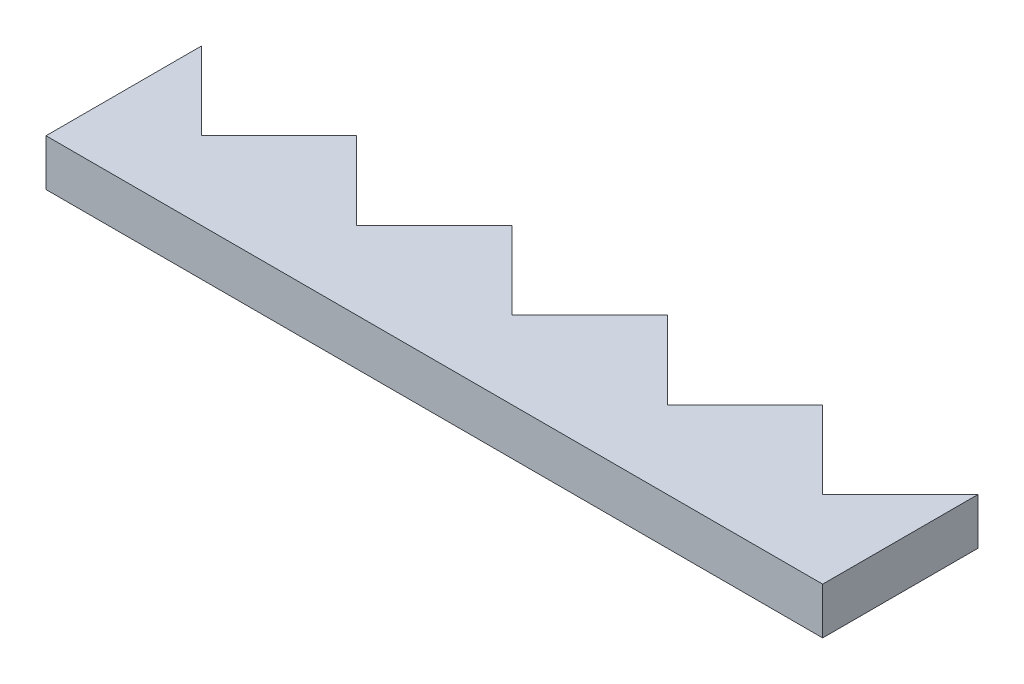
ISO-10303-21;
HEADER;
FILE_DESCRIPTION(('STEP AP214'),'2;1');
FILE_NAME('part.step','',(''),(''),'','','');
FILE_SCHEMA(('AUTOMOTIVE_DESIGN { 1 0 10303 214 1 1 1 1 }'));
ENDSEC;
DATA;
#1=APPLICATION_CONTEXT('core data for automotive mechanical design processes');
#2=APPLICATION_PROTOCOL_DEFINITION('international standard','automotive_design',2000,#1);
#3=PRODUCT_CONTEXT('',#1,'mechanical');
#4=PRODUCT('Part','Part','',(#3));
#5=PRODUCT_RELATED_PRODUCT_CATEGORY('part','',(#4));
#6=PRODUCT_DEFINITION_FORMATION('','',#4);
#7=PRODUCT_DEFINITION_CONTEXT('part definition',#1,'design');
#8=PRODUCT_DEFINITION('design','',#6,#7);
#9=PRODUCT_DEFINITION_SHAPE('','',#8);
#10=(LENGTH_UNIT() NAMED_UNIT(*) SI_UNIT(.MILLI.,.METRE.));
#11=(NAMED_UNIT(*) PLANE_ANGLE_UNIT() SI_UNIT($,.RADIAN.));
#12=(NAMED_UNIT(*) SI_UNIT($,.STERADIAN.) SOLID_ANGLE_UNIT());
#13=UNCERTAINTY_MEASURE_WITH_UNIT(LENGTH_MEASURE(1.E-05),#10,'distance_accuracy_value','');
#14=(GEOMETRIC_REPRESENTATION_CONTEXT(3) GLOBAL_UNCERTAINTY_ASSIGNED_CONTEXT((#13)) GLOBAL_UNIT_ASSIGNED_CONTEXT((#10,
#11,#12)) REPRESENTATION_CONTEXT('',''));
#15=CARTESIAN_POINT('',(0.,0.,0.));
#16=DIRECTION('',(0.,0.,1.));
#17=DIRECTION('',(1.,0.,0.));
#18=AXIS2_PLACEMENT_3D('',#15,#16,#17);
#19=CARTESIAN_POINT('',(0.,3.33025149712782,0.));
#20=DIRECTION('',(0.,0.,-1.));
#21=DIRECTION('',(-1.,0.,0.));
#22=AXIS2_PLACEMENT_3D('',#19,#20,#21);
#23=PLANE('',#22);
#24=DIRECTION('',(1.,0.,0.));
#25=VECTOR('',#24,1.);
#26=CARTESIAN_POINT('',(0.,0.330251497127817,0.));
#27=LINE('',#26,#25);
#28=CARTESIAN_POINT('',(0.,0.330251497127817,0.));
#29=VERTEX_POINT('',#28);
#30=CARTESIAN_POINT('',(50.,0.330251497127817,0.));
#31=VERTEX_POINT('',#30);
#32=EDGE_CURVE('E159',#29,#31,#27,.T.);
#33=ORIENTED_EDGE('',*,*,#32,.T.);
#34=DIRECTION('',(0.,-1.,0.));
#35=VECTOR('',#34,1.);
#36=CARTESIAN_POINT('',(50.,3.33025149712782,0.));
#37=LINE('',#36,#35);
#38=CARTESIAN_POINT('',(50.,3.33025149712782,0.));
#39=VERTEX_POINT('',#38);
#40=EDGE_CURVE('E11',#39,#31,#37,.T.);
#41=ORIENTED_EDGE('',*,*,#40,.F.);
#42=DIRECTION('',(1.,0.,0.));
#43=VECTOR('',#42,1.);
#44=CARTESIAN_POINT('',(0.,3.33025149712782,0.));
#45=LINE('',#44,#43);
#46=CARTESIAN_POINT('',(0.,3.33025149712782,0.));
#47=VERTEX_POINT('',#46);
#48=EDGE_CURVE('E183',#47,#39,#45,.T.);
#49=ORIENTED_EDGE('',*,*,#48,.F.);
#50=DIRECTION('',(0.,-1.,0.));
#51=VECTOR('',#50,1.);
#52=CARTESIAN_POINT('',(0.,3.33025149712782,0.));
#53=LINE('',#52,#51);
#54=EDGE_CURVE('E155',#47,#29,#53,.T.);
#55=ORIENTED_EDGE('',*,*,#54,.T.);
#56=EDGE_LOOP('',(#33,#41,#49,#55));
#57=FACE_BOUND('',#56,.T.);
#58=ADVANCED_FACE('F33',(#57),#23,.F.);
#59=CARTESIAN_POINT('',(50.,3.33025149712782,0.));
#60=DIRECTION('',(-1.,0.,0.));
#61=DIRECTION('',(0.,0.,1.));
#62=AXIS2_PLACEMENT_3D('',#59,#60,#61);
#63=PLANE('',#62);
#64=DIRECTION('',(0.,0.,-1.));
#65=VECTOR('',#64,1.);
#66=CARTESIAN_POINT('',(50.,0.330251497127817,0.));
#67=LINE('',#66,#65);
#68=CARTESIAN_POINT('',(50.,0.330251497127817,-10.));
#69=VERTEX_POINT('',#68);
#70=EDGE_CURVE('E162',#31,#69,#67,.T.);
#71=ORIENTED_EDGE('',*,*,#70,.T.);
#72=DIRECTION('',(0.,-1.,0.));
#73=VECTOR('',#72,1.);
#74=CARTESIAN_POINT('',(50.,3.33025149712782,-10.));
#75=LINE('',#74,#73);
#76=CARTESIAN_POINT('',(50.,3.33025149712782,-10.));
#77=VERTEX_POINT('',#76);
#78=EDGE_CURVE('E41',#77,#69,#75,.T.);
#79=ORIENTED_EDGE('',*,*,#78,.F.);
#80=DIRECTION('',(0.,0.,-1.));
#81=VECTOR('',#80,1.);
#82=CARTESIAN_POINT('',(50.,3.33025149712782,0.));
#83=LINE('',#82,#81);
#84=EDGE_CURVE('E107',#39,#77,#83,.T.);
#85=ORIENTED_EDGE('',*,*,#84,.F.);
#86=ORIENTED_EDGE('',*,*,#40,.T.);
#87=EDGE_LOOP('',(#71,#79,#85,#86));
#88=FACE_BOUND('',#87,.T.);
#89=ADVANCED_FACE('F266',(#88),#63,.F.);
#90=CARTESIAN_POINT('',(45.,3.33025149712782,-5.));
#91=DIRECTION('',(0.707106781186547,0.,0.707106781186548));
#92=DIRECTION('',(0.707106781186548,0.,-0.707106781186547));
#93=AXIS2_PLACEMENT_3D('',#90,#91,#92);
#94=PLANE('',#93);
#95=DIRECTION('',(-0.707106781186548,0.,0.707106781186547));
#96=VECTOR('',#95,1.);
#97=CARTESIAN_POINT('',(45.,0.330251497127817,-5.));
#98=LINE('',#97,#96);
#99=CARTESIAN_POINT('',(45.,0.330251497127817,-5.));
#100=VERTEX_POINT('',#99);
#101=EDGE_CURVE('E164',#69,#100,#98,.T.);
#102=ORIENTED_EDGE('',*,*,#101,.T.);
#103=DIRECTION('',(0.,-1.,0.));
#104=VECTOR('',#103,1.);
#105=CARTESIAN_POINT('',(45.,3.33025149712782,-5.));
#106=LINE('',#105,#104);
#107=CARTESIAN_POINT('',(45.,3.33025149712782,-5.));
#108=VERTEX_POINT('',#107);
#109=EDGE_CURVE('E205',#108,#100,#106,.T.);
#110=ORIENTED_EDGE('',*,*,#109,.F.);
#111=DIRECTION('',(-0.707106781186548,0.,0.707106781186547));
#112=VECTOR('',#111,1.);
#113=CARTESIAN_POINT('',(45.,3.33025149712782,-5.));
#114=LINE('',#113,#112);
#115=EDGE_CURVE('E213',#77,#108,#114,.T.);
#116=ORIENTED_EDGE('',*,*,#115,.F.);
#117=ORIENTED_EDGE('',*,*,#78,.T.);
#118=EDGE_LOOP('',(#102,#110,#116,#117));
#119=FACE_BOUND('',#118,.T.);
#120=ADVANCED_FACE('F211',(#119),#94,.F.);
#121=CARTESIAN_POINT('',(40.,3.33025149712782,-10.));
#122=DIRECTION('',(-0.707106781186548,0.,0.707106781186547));
#123=DIRECTION('',(0.707106781186547,0.,0.707106781186548));
#124=AXIS2_PLACEMENT_3D('',#121,#122,#123);
#125=PLANE('',#124);
#126=DIRECTION('',(-0.707106781186547,0.,-0.707106781186548));
#127=VECTOR('',#126,1.);
#128=CARTESIAN_POINT('',(40.,0.330251497127817,-10.));
#129=LINE('',#128,#127);
#130=CARTESIAN_POINT('',(40.,0.330251497127817,-10.));
#131=VERTEX_POINT('',#130);
#132=EDGE_CURVE('E166',#100,#131,#129,.T.);
#133=ORIENTED_EDGE('',*,*,#132,.T.);
#134=DIRECTION('',(0.,-1.,0.));
#135=VECTOR('',#134,1.);
#136=CARTESIAN_POINT('',(40.,3.33025149712782,-10.));
#137=LINE('',#136,#135);
#138=CARTESIAN_POINT('',(40.,3.33025149712782,-10.));
#139=VERTEX_POINT('',#138);
#140=EDGE_CURVE('E202',#139,#131,#137,.T.);
#141=ORIENTED_EDGE('',*,*,#140,.F.);
#142=DIRECTION('',(-0.707106781186547,0.,-0.707106781186548));
#143=VECTOR('',#142,1.);
#144=CARTESIAN_POINT('',(40.,3.33025149712782,-10.));
#145=LINE('',#144,#143);
#146=EDGE_CURVE('E231',#108,#139,#145,.T.);
#147=ORIENTED_EDGE('',*,*,#146,.F.);
#148=ORIENTED_EDGE('',*,*,#109,.T.);
#149=EDGE_LOOP('',(#133,#141,#147,#148));
#150=FACE_BOUND('',#149,.T.);
#151=ADVANCED_FACE('F222',(#150),#125,.F.);
#152=CARTESIAN_POINT('',(35.,3.33025149712782,-5.));
#153=DIRECTION('',(0.707106781186547,0.,0.707106781186548));
#154=DIRECTION('',(0.707106781186548,0.,-0.707106781186547));
#155=AXIS2_PLACEMENT_3D('',#152,#153,#154);
#156=PLANE('',#155);
#157=DIRECTION('',(-0.707106781186548,0.,0.707106781186547));
#158=VECTOR('',#157,1.);
#159=CARTESIAN_POINT('',(35.,0.330251497127817,-5.));
#160=LINE('',#159,#158);
#161=CARTESIAN_POINT('',(35.,0.330251497127817,-5.));
#162=VERTEX_POINT('',#161);
#163=EDGE_CURVE('E168',#131,#162,#160,.T.);
#164=ORIENTED_EDGE('',*,*,#163,.T.);
#165=DIRECTION('',(0.,-1.,0.));
#166=VECTOR('',#165,1.);
#167=CARTESIAN_POINT('',(35.,3.33025149712782,-5.));
#168=LINE('',#167,#166);
#169=CARTESIAN_POINT('',(35.,3.33025149712782,-5.));
#170=VERTEX_POINT('',#169);
#171=EDGE_CURVE('E199',#170,#162,#168,.T.);
#172=ORIENTED_EDGE('',*,*,#171,.F.);
#173=DIRECTION('',(-0.707106781186548,0.,0.707106781186547));
#174=VECTOR('',#173,1.);
#175=CARTESIAN_POINT('',(35.,3.33025149712782,-5.));
#176=LINE('',#175,#174);
#177=EDGE_CURVE('E228',#139,#170,#176,.T.);
#178=ORIENTED_EDGE('',*,*,#177,.F.);
#179=ORIENTED_EDGE('',*,*,#140,.T.);
#180=EDGE_LOOP('',(#164,#172,#178,#179));
#181=FACE_BOUND('',#180,.T.);
#182=ADVANCED_FACE('F226',(#181),#156,.F.);
#183=CARTESIAN_POINT('',(30.,3.33025149712782,-10.));
#184=DIRECTION('',(-0.707106781186548,0.,0.707106781186547));
#185=DIRECTION('',(0.707106781186547,0.,0.707106781186548));
#186=AXIS2_PLACEMENT_3D('',#183,#184,#185);
#187=PLANE('',#186);
#188=DIRECTION('',(-0.707106781186547,0.,-0.707106781186548));
#189=VECTOR('',#188,1.);
#190=CARTESIAN_POINT('',(30.,0.330251497127817,-10.));
#191=LINE('',#190,#189);
#192=CARTESIAN_POINT('',(30.,0.330251497127817,-10.));
#193=VERTEX_POINT('',#192);
#194=EDGE_CURVE('E170',#162,#193,#191,.T.);
#195=ORIENTED_EDGE('',*,*,#194,.T.);
#196=DIRECTION('',(0.,-1.,0.));
#197=VECTOR('',#196,1.);
#198=CARTESIAN_POINT('',(30.,3.33025149712782,-10.));
#199=LINE('',#198,#197);
#200=CARTESIAN_POINT('',(30.,3.33025149712782,-10.));
#201=VERTEX_POINT('',#200);
#202=EDGE_CURVE('E196',#201,#193,#199,.T.);
#203=ORIENTED_EDGE('',*,*,#202,.F.);
#204=DIRECTION('',(-0.707106781186547,0.,-0.707106781186548));
#205=VECTOR('',#204,1.);
#206=CARTESIAN_POINT('',(30.,3.33025149712782,-10.));
#207=LINE('',#206,#205);
#208=EDGE_CURVE('E230',#170,#201,#207,.T.);
#209=ORIENTED_EDGE('',*,*,#208,.F.);
#210=ORIENTED_EDGE('',*,*,#171,.T.);
#211=EDGE_LOOP('',(#195,#203,#209,#210));
#212=FACE_BOUND('',#211,.T.);
#213=ADVANCED_FACE('F279',(#212),#187,.F.);
#214=CARTESIAN_POINT('',(25.,3.33025149712782,-5.));
#215=DIRECTION('',(0.707106781186548,0.,0.707106781186547));
#216=DIRECTION('',(0.707106781186547,0.,-0.707106781186548));
#217=AXIS2_PLACEMENT_3D('',#214,#215,#216);
#218=PLANE('',#217);
#219=DIRECTION('',(-0.707106781186547,0.,0.707106781186548));
#220=VECTOR('',#219,1.);
#221=CARTESIAN_POINT('',(25.,0.330251497127817,-5.));
#222=LINE('',#221,#220);
#223=CARTESIAN_POINT('',(25.,0.330251497127817,-5.));
#224=VERTEX_POINT('',#223);
#225=EDGE_CURVE('E172',#193,#224,#222,.T.);
#226=ORIENTED_EDGE('',*,*,#225,.T.);
#227=DIRECTION('',(0.,-1.,0.));
#228=VECTOR('',#227,1.);
#229=CARTESIAN_POINT('',(25.,3.33025149712782,-5.));
#230=LINE('',#229,#228);
#231=CARTESIAN_POINT('',(25.,3.33025149712782,-5.));
#232=VERTEX_POINT('',#231);
#233=EDGE_CURVE('E193',#232,#224,#230,.T.);
#234=ORIENTED_EDGE('',*,*,#233,.F.);
#235=DIRECTION('',(-0.707106781186547,0.,0.707106781186548));
#236=VECTOR('',#235,1.);
#237=CARTESIAN_POINT('',(25.,3.33025149712782,-5.));
#238=LINE('',#237,#236);
#239=EDGE_CURVE('E233',#201,#232,#238,.T.);
#240=ORIENTED_EDGE('',*,*,#239,.F.);
#241=ORIENTED_EDGE('',*,*,#202,.T.);
#242=EDGE_LOOP('',(#226,#234,#240,#241));
#243=FACE_BOUND('',#242,.T.);
#244=ADVANCED_FACE('F282',(#243),#218,.F.);
#245=CARTESIAN_POINT('',(20.,3.33025149712782,-10.));
#246=DIRECTION('',(-0.707106781186547,0.,0.707106781186548));
#247=DIRECTION('',(0.707106781186548,0.,0.707106781186547));
#248=AXIS2_PLACEMENT_3D('',#245,#246,#247);
#249=PLANE('',#248);
#250=DIRECTION('',(-0.707106781186548,0.,-0.707106781186547));
#251=VECTOR('',#250,1.);
#252=CARTESIAN_POINT('',(20.,0.330251497127817,-10.));
#253=LINE('',#252,#251);
#254=CARTESIAN_POINT('',(20.,0.330251497127817,-10.));
#255=VERTEX_POINT('',#254);
#256=EDGE_CURVE('E174',#224,#255,#253,.T.);
#257=ORIENTED_EDGE('',*,*,#256,.T.);
#258=DIRECTION('',(0.,-1.,0.));
#259=VECTOR('',#258,1.);
#260=CARTESIAN_POINT('',(20.,3.33025149712782,-10.));
#261=LINE('',#260,#259);
#262=CARTESIAN_POINT('',(20.,3.33025149712782,-10.));
#263=VERTEX_POINT('',#262);
#264=EDGE_CURVE('E190',#263,#255,#261,.T.);
#265=ORIENTED_EDGE('',*,*,#264,.F.);
#266=DIRECTION('',(-0.707106781186548,0.,-0.707106781186547));
#267=VECTOR('',#266,1.);
#268=CARTESIAN_POINT('',(20.,3.33025149712782,-10.));
#269=LINE('',#268,#267);
#270=EDGE_CURVE('E239',#232,#263,#269,.T.);
#271=ORIENTED_EDGE('',*,*,#270,.F.);
#272=ORIENTED_EDGE('',*,*,#233,.T.);
#273=EDGE_LOOP('',(#257,#265,#271,#272));
#274=FACE_BOUND('',#273,.T.);
#275=ADVANCED_FACE('F286',(#274),#249,.F.);
#276=CARTESIAN_POINT('',(15.,3.33025149712782,-5.));
#277=DIRECTION('',(0.707106781186547,0.,0.707106781186548));
#278=DIRECTION('',(0.707106781186548,0.,-0.707106781186547));
#279=AXIS2_PLACEMENT_3D('',#276,#277,#278);
#280=PLANE('',#279);
#281=DIRECTION('',(-0.707106781186548,0.,0.707106781186547));
#282=VECTOR('',#281,1.);
#283=CARTESIAN_POINT('',(15.,0.330251497127817,-5.));
#284=LINE('',#283,#282);
#285=CARTESIAN_POINT('',(15.,0.330251497127817,-5.));
#286=VERTEX_POINT('',#285);
#287=EDGE_CURVE('E176',#255,#286,#284,.T.);
#288=ORIENTED_EDGE('',*,*,#287,.T.);
#289=DIRECTION('',(0.,-1.,0.));
#290=VECTOR('',#289,1.);
#291=CARTESIAN_POINT('',(15.,3.33025149712782,-5.));
#292=LINE('',#291,#290);
#293=CARTESIAN_POINT('',(15.,3.33025149712782,-5.));
#294=VERTEX_POINT('',#293);
#295=EDGE_CURVE('E187',#294,#286,#292,.T.);
#296=ORIENTED_EDGE('',*,*,#295,.F.);
#297=DIRECTION('',(-0.707106781186548,0.,0.707106781186547));
#298=VECTOR('',#297,1.);
#299=CARTESIAN_POINT('',(15.,3.33025149712782,-5.));
#300=LINE('',#299,#298);
#301=EDGE_CURVE('E241',#263,#294,#300,.T.);
#302=ORIENTED_EDGE('',*,*,#301,.F.);
#303=ORIENTED_EDGE('',*,*,#264,.T.);
#304=EDGE_LOOP('',(#288,#296,#302,#303));
#305=FACE_BOUND('',#304,.T.);
#306=ADVANCED_FACE('F247',(#305),#280,.F.);
#307=CARTESIAN_POINT('',(10.,3.33025149712782,-10.));
#308=DIRECTION('',(-0.707106781186548,0.,0.707106781186547));
#309=DIRECTION('',(0.707106781186547,0.,0.707106781186548));
#310=AXIS2_PLACEMENT_3D('',#307,#308,#309);
#311=PLANE('',#310);
#312=DIRECTION('',(-0.707106781186547,0.,-0.707106781186548));
#313=VECTOR('',#312,1.);
#314=CARTESIAN_POINT('',(10.,0.330251497127817,-10.));
#315=LINE('',#314,#313);
#316=CARTESIAN_POINT('',(10.,0.330251497127817,-10.));
#317=VERTEX_POINT('',#316);
#318=EDGE_CURVE('E178',#286,#317,#315,.T.);
#319=ORIENTED_EDGE('',*,*,#318,.T.);
#320=DIRECTION('',(0.,-1.,0.));
#321=VECTOR('',#320,1.);
#322=CARTESIAN_POINT('',(10.,3.33025149712782,-10.));
#323=LINE('',#322,#321);
#324=CARTESIAN_POINT('',(10.,3.33025149712782,-10.));
#325=VERTEX_POINT('',#324);
#326=EDGE_CURVE('E150',#325,#317,#323,.T.);
#327=ORIENTED_EDGE('',*,*,#326,.F.);
#328=DIRECTION('',(-0.707106781186547,0.,-0.707106781186548));
#329=VECTOR('',#328,1.);
#330=CARTESIAN_POINT('',(10.,3.33025149712782,-10.));
#331=LINE('',#330,#329);
#332=EDGE_CURVE('E141',#294,#325,#331,.T.);
#333=ORIENTED_EDGE('',*,*,#332,.F.);
#334=ORIENTED_EDGE('',*,*,#295,.T.);
#335=EDGE_LOOP('',(#319,#327,#333,#334));
#336=FACE_BOUND('',#335,.T.);
#337=ADVANCED_FACE('F251',(#336),#311,.F.);
#338=CARTESIAN_POINT('',(5.,3.33025149712782,-5.));
#339=DIRECTION('',(0.707106781186547,0.,0.707106781186547));
#340=DIRECTION('',(0.707106781186548,0.,-0.707106781186548));
#341=AXIS2_PLACEMENT_3D('',#338,#339,#340);
#342=PLANE('',#341);
#343=DIRECTION('',(-0.707106781186548,0.,0.707106781186548));
#344=VECTOR('',#343,1.);
#345=CARTESIAN_POINT('',(5.,0.330251497127817,-5.));
#346=LINE('',#345,#344);
#347=CARTESIAN_POINT('',(5.,0.330251497127817,-5.));
#348=VERTEX_POINT('',#347);
#349=EDGE_CURVE('E149',#317,#348,#346,.T.);
#350=ORIENTED_EDGE('',*,*,#349,.T.);
#351=DIRECTION('',(0.,-1.,0.));
#352=VECTOR('',#351,1.);
#353=CARTESIAN_POINT('',(5.,3.33025149712782,-5.));
#354=LINE('',#353,#352);
#355=CARTESIAN_POINT('',(5.,3.33025149712782,-5.));
#356=VERTEX_POINT('',#355);
#357=EDGE_CURVE('E146',#356,#348,#354,.T.);
#358=ORIENTED_EDGE('',*,*,#357,.F.);
#359=DIRECTION('',(-0.707106781186548,0.,0.707106781186548));
#360=VECTOR('',#359,1.);
#361=CARTESIAN_POINT('',(5.,3.33025149712782,-5.));
#362=LINE('',#361,#360);
#363=EDGE_CURVE('E135',#325,#356,#362,.T.);
#364=ORIENTED_EDGE('',*,*,#363,.F.);
#365=ORIENTED_EDGE('',*,*,#326,.T.);
#366=EDGE_LOOP('',(#350,#358,#364,#365));
#367=FACE_BOUND('',#366,.T.);
#368=ADVANCED_FACE('F147',(#367),#342,.F.);
#369=CARTESIAN_POINT('',(0.,3.33025149712782,-10.));
#370=DIRECTION('',(-0.707106781186547,0.,0.707106781186547));
#371=DIRECTION('',(0.707106781186548,0.,0.707106781186548));
#372=AXIS2_PLACEMENT_3D('',#369,#370,#371);
#373=PLANE('',#372);
#374=DIRECTION('',(-0.707106781186548,0.,-0.707106781186548));
#375=VECTOR('',#374,1.);
#376=CARTESIAN_POINT('',(0.,0.330251497127817,-10.));
#377=LINE('',#376,#375);
#378=CARTESIAN_POINT('',(0.,0.330251497127817,-10.));
#379=VERTEX_POINT('',#378);
#380=EDGE_CURVE('E93',#348,#379,#377,.T.);
#381=ORIENTED_EDGE('',*,*,#380,.T.);
#382=DIRECTION('',(0.,-1.,0.));
#383=VECTOR('',#382,1.);
#384=CARTESIAN_POINT('',(0.,3.33025149712782,-10.));
#385=LINE('',#384,#383);
#386=CARTESIAN_POINT('',(0.,3.33025149712782,-10.));
#387=VERTEX_POINT('',#386);
#388=EDGE_CURVE('E151',#387,#379,#385,.T.);
#389=ORIENTED_EDGE('',*,*,#388,.F.);
#390=DIRECTION('',(-0.707106781186548,0.,-0.707106781186548));
#391=VECTOR('',#390,1.);
#392=CARTESIAN_POINT('',(0.,3.33025149712782,-10.));
#393=LINE('',#392,#391);
#394=EDGE_CURVE('E139',#356,#387,#393,.T.);
#395=ORIENTED_EDGE('',*,*,#394,.F.);
#396=ORIENTED_EDGE('',*,*,#357,.T.);
#397=EDGE_LOOP('',(#381,#389,#395,#396));
#398=FACE_BOUND('',#397,.T.);
#399=ADVANCED_FACE('F153',(#398),#373,.F.);
#400=CARTESIAN_POINT('',(0.,3.33025149712782,0.));
#401=DIRECTION('',(1.,0.,0.));
#402=DIRECTION('',(0.,0.,-1.));
#403=AXIS2_PLACEMENT_3D('',#400,#401,#402);
#404=PLANE('',#403);
#405=DIRECTION('',(0.,0.,1.));
#406=VECTOR('',#405,1.);
#407=CARTESIAN_POINT('',(0.,0.330251497127817,0.));
#408=LINE('',#407,#406);
#409=EDGE_CURVE('E99',#379,#29,#408,.T.);
#410=ORIENTED_EDGE('',*,*,#409,.T.);
#411=ORIENTED_EDGE('',*,*,#54,.F.);
#412=DIRECTION('',(0.,0.,1.));
#413=VECTOR('',#412,1.);
#414=CARTESIAN_POINT('',(0.,3.33025149712782,0.));
#415=LINE('',#414,#413);
#416=EDGE_CURVE('E49',#387,#47,#415,.T.);
#417=ORIENTED_EDGE('',*,*,#416,.F.);
#418=ORIENTED_EDGE('',*,*,#388,.T.);
#419=EDGE_LOOP('',(#410,#411,#417,#418));
#420=FACE_BOUND('',#419,.T.);
#421=ADVANCED_FACE('F255',(#420),#404,.F.);
#422=CARTESIAN_POINT('',(0.,3.33025149712782,0.));
#423=DIRECTION('',(0.,1.,0.));
#424=DIRECTION('',(0.,0.,1.));
#425=AXIS2_PLACEMENT_3D('',#422,#423,#424);
#426=PLANE('',#425);
#427=ORIENTED_EDGE('',*,*,#48,.T.);
#428=ORIENTED_EDGE('',*,*,#84,.T.);
#429=ORIENTED_EDGE('',*,*,#115,.T.);
#430=ORIENTED_EDGE('',*,*,#146,.T.);
#431=ORIENTED_EDGE('',*,*,#177,.T.);
#432=ORIENTED_EDGE('',*,*,#208,.T.);
#433=ORIENTED_EDGE('',*,*,#239,.T.);
#434=ORIENTED_EDGE('',*,*,#270,.T.);
#435=ORIENTED_EDGE('',*,*,#301,.T.);
#436=ORIENTED_EDGE('',*,*,#332,.T.);
#437=ORIENTED_EDGE('',*,*,#363,.T.);
#438=ORIENTED_EDGE('',*,*,#394,.T.);
#439=ORIENTED_EDGE('',*,*,#416,.T.);
#440=EDGE_LOOP('',(#427,#428,#429,#430,#431,#432,#433,#434,#435,#436,#437,#438,#439));
#441=FACE_BOUND('',#440,.T.);
#442=ADVANCED_FACE('F137',(#441),#426,.T.);
#443=CARTESIAN_POINT('',(0.,0.330251497127817,0.));
#444=DIRECTION('',(0.,1.,0.));
#445=DIRECTION('',(0.,0.,1.));
#446=AXIS2_PLACEMENT_3D('',#443,#444,#445);
#447=PLANE('',#446);
#448=ORIENTED_EDGE('',*,*,#32,.F.);
#449=ORIENTED_EDGE('',*,*,#409,.F.);
#450=ORIENTED_EDGE('',*,*,#380,.F.);
#451=ORIENTED_EDGE('',*,*,#349,.F.);
#452=ORIENTED_EDGE('',*,*,#318,.F.);
#453=ORIENTED_EDGE('',*,*,#287,.F.);
#454=ORIENTED_EDGE('',*,*,#256,.F.);
#455=ORIENTED_EDGE('',*,*,#225,.F.);
#456=ORIENTED_EDGE('',*,*,#194,.F.);
#457=ORIENTED_EDGE('',*,*,#163,.F.);
#458=ORIENTED_EDGE('',*,*,#132,.F.);
#459=ORIENTED_EDGE('',*,*,#101,.F.);
#460=ORIENTED_EDGE('',*,*,#70,.F.);
#461=EDGE_LOOP('',(#448,#449,#450,#451,#452,#453,#454,#455,#456,#457,#458,#459,#460));
#462=FACE_BOUND('',#461,.T.);
#463=ADVANCED_FACE('F217',(#462),#447,.F.);
#464=CLOSED_SHELL('',(#58,#89,#120,#151,#182,#213,#244,#275,#306,#337,#368,#399,#421,#442,#463));
#465=MANIFOLD_SOLID_BREP('B2',#464);
#466=ADVANCED_BREP_SHAPE_REPRESENTATION('',(#18,#465),#14);
#467=SHAPE_DEFINITION_REPRESENTATION(#9,#466);
ENDSEC;
END-ISO-10303-21;
